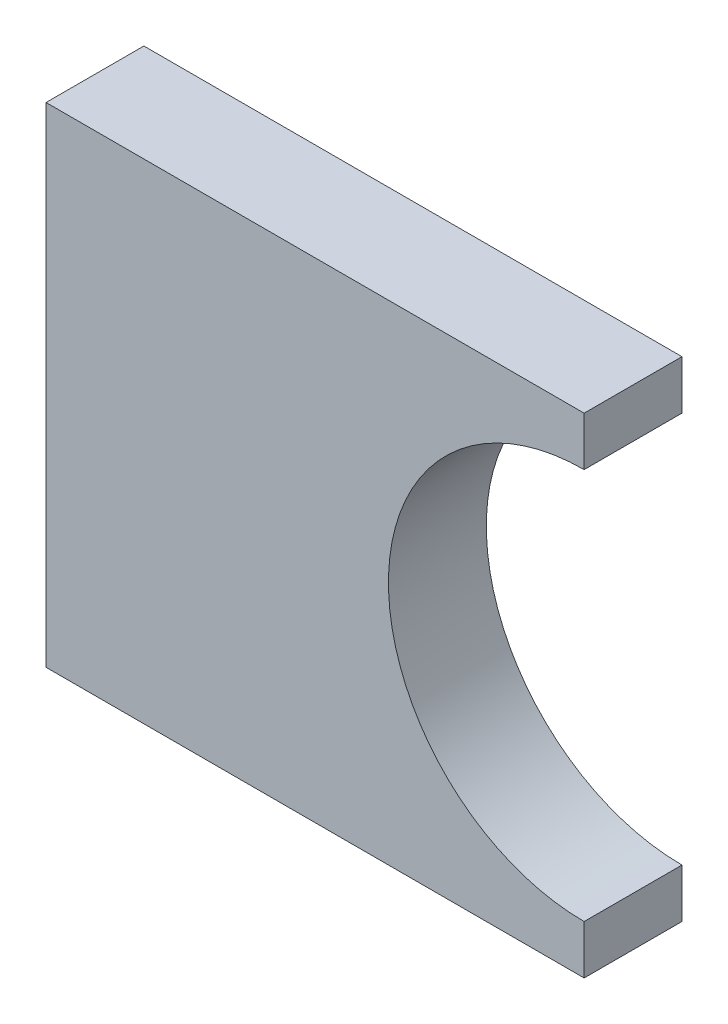
ISO-10303-21;
HEADER;
FILE_DESCRIPTION(('STEP AP214'),'2;1');
FILE_NAME('part.step','',(''),(''),'','','');
FILE_SCHEMA(('AUTOMOTIVE_DESIGN { 1 0 10303 214 1 1 1 1 }'));
ENDSEC;
DATA;
#1=APPLICATION_CONTEXT('core data for automotive mechanical design processes');
#2=APPLICATION_PROTOCOL_DEFINITION('international standard','automotive_design',2000,#1);
#3=PRODUCT_CONTEXT('',#1,'mechanical');
#4=PRODUCT('Part','Part','',(#3));
#5=PRODUCT_RELATED_PRODUCT_CATEGORY('part','',(#4));
#6=PRODUCT_DEFINITION_FORMATION('','',#4);
#7=PRODUCT_DEFINITION_CONTEXT('part definition',#1,'design');
#8=PRODUCT_DEFINITION('design','',#6,#7);
#9=PRODUCT_DEFINITION_SHAPE('','',#8);
#10=(LENGTH_UNIT() NAMED_UNIT(*) SI_UNIT(.MILLI.,.METRE.));
#11=(NAMED_UNIT(*) PLANE_ANGLE_UNIT() SI_UNIT($,.RADIAN.));
#12=(NAMED_UNIT(*) SI_UNIT($,.STERADIAN.) SOLID_ANGLE_UNIT());
#13=UNCERTAINTY_MEASURE_WITH_UNIT(LENGTH_MEASURE(1.E-05),#10,'distance_accuracy_value','');
#14=(GEOMETRIC_REPRESENTATION_CONTEXT(3) GLOBAL_UNCERTAINTY_ASSIGNED_CONTEXT((#13)) GLOBAL_UNIT_ASSIGNED_CONTEXT((#10,
#11,#12)) REPRESENTATION_CONTEXT('',''));
#15=CARTESIAN_POINT('',(0.,0.,0.));
#16=DIRECTION('',(0.,0.,1.));
#17=DIRECTION('',(1.,0.,0.));
#18=AXIS2_PLACEMENT_3D('',#15,#16,#17);
#19=CARTESIAN_POINT('',(27.5,-25.0000000000006,5.));
#20=DIRECTION('',(1.00000000000001,0.,0.));
#21=DIRECTION('',(0.,-1.00000000000001,0.));
#22=AXIS2_PLACEMENT_3D('',#19,#20,#21);
#23=PLANE('',#22);
#24=DIRECTION('',(0.,0.,1.));
#25=VECTOR('',#24,1.);
#26=CARTESIAN_POINT('',(27.5000000000012,20.,5.));
#27=LINE('',#26,#25);
#28=CARTESIAN_POINT('',(27.5000000000012,20.,-5.));
#29=VERTEX_POINT('',#28);
#30=CARTESIAN_POINT('',(27.5000000000012,20.,5.));
#31=VERTEX_POINT('',#30);
#32=EDGE_CURVE('E12',#29,#31,#27,.T.);
#33=ORIENTED_EDGE('',*,*,#32,.F.);
#34=DIRECTION('',(0.,1.00000000000001,0.));
#35=VECTOR('',#34,1.);
#36=CARTESIAN_POINT('',(27.5,-25.0000000000006,-5.));
#37=LINE('',#36,#35);
#38=CARTESIAN_POINT('',(27.5000000000012,25.0000000000006,-5.));
#39=VERTEX_POINT('',#38);
#40=EDGE_CURVE('E120',#39,#29,#37,.F.);
#41=ORIENTED_EDGE('',*,*,#40,.F.);
#42=DIRECTION('',(0.,0.,1.));
#43=VECTOR('',#42,1.);
#44=CARTESIAN_POINT('',(27.5000000000012,25.0000000000006,5.));
#45=LINE('',#44,#43);
#46=CARTESIAN_POINT('',(27.5000000000012,25.0000000000006,5.));
#47=VERTEX_POINT('',#46);
#48=EDGE_CURVE('E68',#39,#47,#45,.T.);
#49=ORIENTED_EDGE('',*,*,#48,.T.);
#50=DIRECTION('',(0.,-1.00000000000001,0.));
#51=VECTOR('',#50,1.);
#52=CARTESIAN_POINT('',(27.5,-25.0000000000006,5.));
#53=LINE('',#52,#51);
#54=EDGE_CURVE('E159',#47,#31,#53,.T.);
#55=ORIENTED_EDGE('',*,*,#54,.T.);
#56=EDGE_LOOP('',(#33,#41,#49,#55));
#57=FACE_BOUND('',#56,.T.);
#58=ADVANCED_FACE('F57',(#57),#23,.T.);
#59=CARTESIAN_POINT('',(27.5000000000012,25.0000000000006,5.));
#60=DIRECTION('',(0.,-1.00000000000001,0.));
#61=DIRECTION('',(-1.00000000000001,0.,0.));
#62=AXIS2_PLACEMENT_3D('',#59,#60,#61);
#63=PLANE('',#62);
#64=ORIENTED_EDGE('',*,*,#48,.F.);
#65=DIRECTION('',(-1.00000000000001,0.,0.));
#66=VECTOR('',#65,1.);
#67=CARTESIAN_POINT('',(27.5000000000012,25.0000000000006,-5.));
#68=LINE('',#67,#66);
#69=CARTESIAN_POINT('',(-27.4999999999989,25.0000000000006,-5.));
#70=VERTEX_POINT('',#69);
#71=EDGE_CURVE('E138',#39,#70,#68,.T.);
#72=ORIENTED_EDGE('',*,*,#71,.T.);
#73=DIRECTION('',(0.,0.,1.));
#74=VECTOR('',#73,1.);
#75=CARTESIAN_POINT('',(-27.4999999999989,25.0000000000006,5.));
#76=LINE('',#75,#74);
#77=CARTESIAN_POINT('',(-27.4999999999989,25.0000000000006,5.));
#78=VERTEX_POINT('',#77);
#79=EDGE_CURVE('E149',#70,#78,#76,.T.);
#80=ORIENTED_EDGE('',*,*,#79,.T.);
#81=DIRECTION('',(-1.00000000000001,0.,0.));
#82=VECTOR('',#81,1.);
#83=CARTESIAN_POINT('',(27.5000000000012,25.0000000000006,5.));
#84=LINE('',#83,#82);
#85=EDGE_CURVE('E167',#47,#78,#84,.T.);
#86=ORIENTED_EDGE('',*,*,#85,.F.);
#87=EDGE_LOOP('',(#64,#72,#80,#86));
#88=FACE_BOUND('',#87,.T.);
#89=ADVANCED_FACE('F171',(#88),#63,.F.);
#90=CARTESIAN_POINT('',(-27.5,-25.0000000000003,5.));
#91=DIRECTION('',(1.00000000000001,0.,0.));
#92=DIRECTION('',(0.,-1.00000000000001,0.));
#93=AXIS2_PLACEMENT_3D('',#90,#91,#92);
#94=PLANE('',#93);
#95=ORIENTED_EDGE('',*,*,#79,.F.);
#96=DIRECTION('',(0.,1.00000000000001,0.));
#97=VECTOR('',#96,1.);
#98=CARTESIAN_POINT('',(-27.5,-25.0000000000003,-5.));
#99=LINE('',#98,#97);
#100=CARTESIAN_POINT('',(-27.5,-25.0000000000003,-5.));
#101=VERTEX_POINT('',#100);
#102=EDGE_CURVE('E134',#70,#101,#99,.F.);
#103=ORIENTED_EDGE('',*,*,#102,.T.);
#104=DIRECTION('',(0.,0.,1.));
#105=VECTOR('',#104,1.);
#106=CARTESIAN_POINT('',(-27.5,-25.0000000000003,5.));
#107=LINE('',#106,#105);
#108=CARTESIAN_POINT('',(-27.5,-25.0000000000003,5.));
#109=VERTEX_POINT('',#108);
#110=EDGE_CURVE('E146',#101,#109,#107,.T.);
#111=ORIENTED_EDGE('',*,*,#110,.T.);
#112=DIRECTION('',(0.,-1.00000000000001,0.));
#113=VECTOR('',#112,1.);
#114=CARTESIAN_POINT('',(-27.5,-25.0000000000003,5.));
#115=LINE('',#114,#113);
#116=EDGE_CURVE('E173',#78,#109,#115,.T.);
#117=ORIENTED_EDGE('',*,*,#116,.F.);
#118=EDGE_LOOP('',(#95,#103,#111,#117));
#119=FACE_BOUND('',#118,.T.);
#120=ADVANCED_FACE('F192',(#119),#94,.F.);
#121=CARTESIAN_POINT('',(27.5,-25.0000000000006,5.));
#122=DIRECTION('',(0.,-1.00000000000001,0.));
#123=DIRECTION('',(-1.00000000000001,0.,0.));
#124=AXIS2_PLACEMENT_3D('',#121,#122,#123);
#125=PLANE('',#124);
#126=ORIENTED_EDGE('',*,*,#110,.F.);
#127=DIRECTION('',(-1.00000000000001,0.,0.));
#128=VECTOR('',#127,1.);
#129=CARTESIAN_POINT('',(27.5,-25.0000000000006,-5.));
#130=LINE('',#129,#128);
#131=CARTESIAN_POINT('',(27.5,-25.0000000000006,-5.));
#132=VERTEX_POINT('',#131);
#133=EDGE_CURVE('E130',#132,#101,#130,.T.);
#134=ORIENTED_EDGE('',*,*,#133,.F.);
#135=DIRECTION('',(0.,0.,1.));
#136=VECTOR('',#135,1.);
#137=CARTESIAN_POINT('',(27.5,-25.0000000000006,5.));
#138=LINE('',#137,#136);
#139=CARTESIAN_POINT('',(27.5,-25.0000000000006,5.));
#140=VERTEX_POINT('',#139);
#141=EDGE_CURVE('E76',#132,#140,#138,.T.);
#142=ORIENTED_EDGE('',*,*,#141,.T.);
#143=DIRECTION('',(-1.00000000000001,0.,0.));
#144=VECTOR('',#143,1.);
#145=CARTESIAN_POINT('',(27.5,-25.0000000000006,5.));
#146=LINE('',#145,#144);
#147=EDGE_CURVE('E113',#140,#109,#146,.T.);
#148=ORIENTED_EDGE('',*,*,#147,.T.);
#149=EDGE_LOOP('',(#126,#134,#142,#148));
#150=FACE_BOUND('',#149,.T.);
#151=ADVANCED_FACE('F189',(#150),#125,.T.);
#152=ORIENTED_EDGE('',*,*,#141,.F.);
#153=DIRECTION('',(0.,1.00000000000001,0.));
#154=VECTOR('',#153,1.);
#155=CARTESIAN_POINT('',(27.5,-25.0000000000006,-5.));
#156=LINE('',#155,#154);
#157=CARTESIAN_POINT('',(27.5,-20.0000000000006,-5.));
#158=VERTEX_POINT('',#157);
#159=EDGE_CURVE('E118',#158,#132,#156,.F.);
#160=ORIENTED_EDGE('',*,*,#159,.F.);
#161=DIRECTION('',(0.,0.,1.));
#162=VECTOR('',#161,1.);
#163=CARTESIAN_POINT('',(27.5,-20.0000000000006,5.));
#164=LINE('',#163,#162);
#165=CARTESIAN_POINT('',(27.5,-20.0000000000006,5.));
#166=VERTEX_POINT('',#165);
#167=EDGE_CURVE('E61',#158,#166,#164,.T.);
#168=ORIENTED_EDGE('',*,*,#167,.T.);
#169=EDGE_CURVE('E133',#166,#140,#53,.T.);
#170=ORIENTED_EDGE('',*,*,#169,.T.);
#171=EDGE_LOOP('',(#152,#160,#168,#170));
#172=FACE_BOUND('',#171,.T.);
#173=ADVANCED_FACE('F123',(#172),#23,.T.);
#174=CARTESIAN_POINT('',(27.5,0.,5.));
#175=DIRECTION('',(0.,0.,-1.));
#176=DIRECTION('',(-1.00000000000001,0.,0.));
#177=AXIS2_PLACEMENT_3D('',#174,#175,#176);
#178=CYLINDRICAL_SURFACE('',#177,20.);
#179=CARTESIAN_POINT('',(27.5,0.,-5.));
#180=DIRECTION('',(0.,0.,1.));
#181=DIRECTION('',(1.00000000000001,0.,0.));
#182=AXIS2_PLACEMENT_3D('',#179,#180,#181);
#183=CIRCLE('',#182,20.);
#184=EDGE_CURVE('E106',#29,#158,#183,.T.);
#185=ORIENTED_EDGE('',*,*,#184,.F.);
#186=ORIENTED_EDGE('',*,*,#32,.T.);
#187=CARTESIAN_POINT('',(27.5,0.,5.));
#188=DIRECTION('',(0.,0.,1.));
#189=DIRECTION('',(1.00000000000001,0.,0.));
#190=AXIS2_PLACEMENT_3D('',#187,#188,#189);
#191=CIRCLE('',#190,20.);
#192=EDGE_CURVE('E108',#31,#166,#191,.T.);
#193=ORIENTED_EDGE('',*,*,#192,.T.);
#194=ORIENTED_EDGE('',*,*,#167,.F.);
#195=EDGE_LOOP('',(#185,#186,#193,#194));
#196=FACE_BOUND('',#195,.T.);
#197=ADVANCED_FACE('F59',(#196),#178,.F.);
#198=CARTESIAN_POINT('',(27.5,-25.0000000000006,5.));
#199=DIRECTION('',(0.,0.,-1.));
#200=DIRECTION('',(-1.00000000000001,0.,0.));
#201=AXIS2_PLACEMENT_3D('',#198,#199,#200);
#202=PLANE('',#201);
#203=ORIENTED_EDGE('',*,*,#169,.F.);
#204=ORIENTED_EDGE('',*,*,#192,.F.);
#205=ORIENTED_EDGE('',*,*,#54,.F.);
#206=ORIENTED_EDGE('',*,*,#85,.T.);
#207=ORIENTED_EDGE('',*,*,#116,.T.);
#208=ORIENTED_EDGE('',*,*,#147,.F.);
#209=EDGE_LOOP('',(#203,#204,#205,#206,#207,#208));
#210=FACE_BOUND('',#209,.T.);
#211=ADVANCED_FACE('F165',(#210),#202,.F.);
#212=CARTESIAN_POINT('',(27.5,-25.0000000000006,-5.));
#213=DIRECTION('',(0.,0.,-1.));
#214=DIRECTION('',(-1.00000000000001,0.,0.));
#215=AXIS2_PLACEMENT_3D('',#212,#213,#214);
#216=PLANE('',#215);
#217=ORIENTED_EDGE('',*,*,#159,.T.);
#218=ORIENTED_EDGE('',*,*,#133,.T.);
#219=ORIENTED_EDGE('',*,*,#102,.F.);
#220=ORIENTED_EDGE('',*,*,#71,.F.);
#221=ORIENTED_EDGE('',*,*,#40,.T.);
#222=ORIENTED_EDGE('',*,*,#184,.T.);
#223=EDGE_LOOP('',(#217,#218,#219,#220,#221,#222));
#224=FACE_BOUND('',#223,.T.);
#225=ADVANCED_FACE('F116',(#224),#216,.T.);
#226=CLOSED_SHELL('',(#58,#89,#120,#151,#173,#197,#211,#225));
#227=MANIFOLD_SOLID_BREP('B2',#226);
#228=ADVANCED_BREP_SHAPE_REPRESENTATION('',(#18,#227),#14);
#229=SHAPE_DEFINITION_REPRESENTATION(#9,#228);
ENDSEC;
END-ISO-10303-21;
